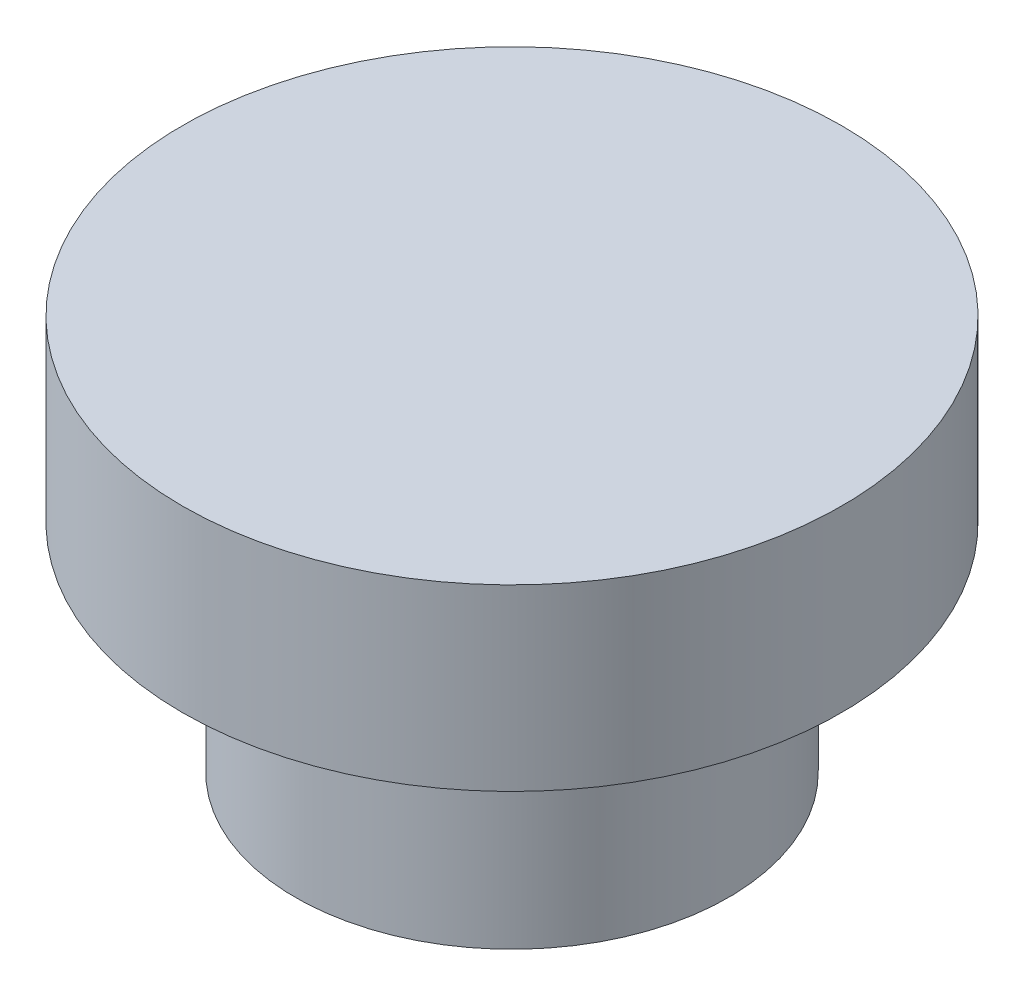
ISO-10303-21;
HEADER;
FILE_DESCRIPTION(('STEP AP214'),'2;1');
FILE_NAME('part.step','',(''),(''),'','','');
FILE_SCHEMA(('AUTOMOTIVE_DESIGN { 1 0 10303 214 1 1 1 1 }'));
ENDSEC;
DATA;
#1=APPLICATION_CONTEXT('core data for automotive mechanical design processes');
#2=APPLICATION_PROTOCOL_DEFINITION('international standard','automotive_design',2000,#1);
#3=PRODUCT_CONTEXT('',#1,'mechanical');
#4=PRODUCT('Part','Part','',(#3));
#5=PRODUCT_RELATED_PRODUCT_CATEGORY('part','',(#4));
#6=PRODUCT_DEFINITION_FORMATION('','',#4);
#7=PRODUCT_DEFINITION_CONTEXT('part definition',#1,'design');
#8=PRODUCT_DEFINITION('design','',#6,#7);
#9=PRODUCT_DEFINITION_SHAPE('','',#8);
#10=(LENGTH_UNIT() NAMED_UNIT(*) SI_UNIT(.MILLI.,.METRE.));
#11=(NAMED_UNIT(*) PLANE_ANGLE_UNIT() SI_UNIT($,.RADIAN.));
#12=(NAMED_UNIT(*) SI_UNIT($,.STERADIAN.) SOLID_ANGLE_UNIT());
#13=UNCERTAINTY_MEASURE_WITH_UNIT(LENGTH_MEASURE(1.E-05),#10,'distance_accuracy_value','');
#14=(GEOMETRIC_REPRESENTATION_CONTEXT(3) GLOBAL_UNCERTAINTY_ASSIGNED_CONTEXT((#13)) GLOBAL_UNIT_ASSIGNED_CONTEXT((#10,
#11,#12)) REPRESENTATION_CONTEXT('',''));
#15=CARTESIAN_POINT('',(0.,0.,0.));
#16=DIRECTION('',(0.,0.,1.));
#17=DIRECTION('',(1.,0.,0.));
#18=AXIS2_PLACEMENT_3D('',#15,#16,#17);
#19=CARTESIAN_POINT('',(2.921,0.,0.));
#20=DIRECTION('',(0.,-1.,0.));
#21=DIRECTION('',(0.,0.,-1.));
#22=AXIS2_PLACEMENT_3D('',#19,#20,#21);
#23=PLANE('',#22);
#24=CARTESIAN_POINT('',(0.,0.,0.));
#25=DIRECTION('',(0.,-1.,0.));
#26=DIRECTION('',(0.,0.,-1.));
#27=AXIS2_PLACEMENT_3D('',#24,#25,#26);
#28=CIRCLE('',#27,2.921);
#29=CARTESIAN_POINT('',(0.,0.,-2.921));
#30=VERTEX_POINT('',#29);
#31=EDGE_CURVE('E46',#30,#30,#28,.T.);
#32=ORIENTED_EDGE('',*,*,#31,.T.);
#33=EDGE_LOOP('',(#32));
#34=FACE_BOUND('',#33,.T.);
#35=ADVANCED_FACE('F32',(#34),#23,.T.);
#36=CARTESIAN_POINT('',(0.,5.334,0.));
#37=DIRECTION('',(0.,1.,0.));
#38=DIRECTION('',(0.,0.,1.));
#39=AXIS2_PLACEMENT_3D('',#36,#37,#38);
#40=PLANE('',#39);
#41=CARTESIAN_POINT('',(0.,5.334,0.));
#42=DIRECTION('',(0.,-1.,0.));
#43=DIRECTION('',(0.,0.,-1.));
#44=AXIS2_PLACEMENT_3D('',#41,#42,#43);
#45=CIRCLE('',#44,4.445);
#46=CARTESIAN_POINT('',(0.,5.334,-4.445));
#47=VERTEX_POINT('',#46);
#48=EDGE_CURVE('E10',#47,#47,#45,.T.);
#49=ORIENTED_EDGE('',*,*,#48,.F.);
#50=EDGE_LOOP('',(#49));
#51=FACE_BOUND('',#50,.T.);
#52=ADVANCED_FACE('F64',(#51),#40,.T.);
#53=CARTESIAN_POINT('',(0.,0.,0.));
#54=DIRECTION('',(0.,-1.,0.));
#55=DIRECTION('',(0.,0.,-1.));
#56=AXIS2_PLACEMENT_3D('',#53,#54,#55);
#57=CYLINDRICAL_SURFACE('',#56,4.445);
#58=ORIENTED_EDGE('',*,*,#48,.T.);
#59=EDGE_LOOP('',(#58));
#60=FACE_BOUND('',#59,.T.);
#61=CARTESIAN_POINT('',(0.,2.921,0.));
#62=DIRECTION('',(0.,-1.,0.));
#63=DIRECTION('',(0.,0.,-1.));
#64=AXIS2_PLACEMENT_3D('',#61,#62,#63);
#65=CIRCLE('',#64,4.445);
#66=CARTESIAN_POINT('',(0.,2.921,-4.445));
#67=VERTEX_POINT('',#66);
#68=EDGE_CURVE('E38',#67,#67,#65,.T.);
#69=ORIENTED_EDGE('',*,*,#68,.F.);
#70=EDGE_LOOP('',(#69));
#71=FACE_BOUND('',#70,.T.);
#72=ADVANCED_FACE('F61',(#60,#71),#57,.T.);
#73=CARTESIAN_POINT('',(4.445,2.921,0.));
#74=DIRECTION('',(0.,-1.,0.));
#75=DIRECTION('',(0.,0.,-1.));
#76=AXIS2_PLACEMENT_3D('',#73,#74,#75);
#77=PLANE('',#76);
#78=ORIENTED_EDGE('',*,*,#68,.T.);
#79=EDGE_LOOP('',(#78));
#80=FACE_BOUND('',#79,.T.);
#81=CARTESIAN_POINT('',(0.,2.921,0.));
#82=DIRECTION('',(0.,-1.,0.));
#83=DIRECTION('',(0.,0.,-1.));
#84=AXIS2_PLACEMENT_3D('',#81,#82,#83);
#85=CIRCLE('',#84,2.921);
#86=CARTESIAN_POINT('',(0.,2.921,-2.921));
#87=VERTEX_POINT('',#86);
#88=EDGE_CURVE('E42',#87,#87,#85,.T.);
#89=ORIENTED_EDGE('',*,*,#88,.F.);
#90=EDGE_LOOP('',(#89));
#91=FACE_BOUND('',#90,.T.);
#92=ADVANCED_FACE('F55',(#80,#91),#77,.T.);
#93=CARTESIAN_POINT('',(0.,0.,0.));
#94=DIRECTION('',(0.,-1.,0.));
#95=DIRECTION('',(0.,0.,-1.));
#96=AXIS2_PLACEMENT_3D('',#93,#94,#95);
#97=CYLINDRICAL_SURFACE('',#96,2.921);
#98=ORIENTED_EDGE('',*,*,#88,.T.);
#99=EDGE_LOOP('',(#98));
#100=FACE_BOUND('',#99,.T.);
#101=ORIENTED_EDGE('',*,*,#31,.F.);
#102=EDGE_LOOP('',(#101));
#103=FACE_BOUND('',#102,.T.);
#104=ADVANCED_FACE('F53',(#100,#103),#97,.T.);
#105=CLOSED_SHELL('',(#35,#52,#72,#92,#104));
#106=MANIFOLD_SOLID_BREP('B2',#105);
#107=ADVANCED_BREP_SHAPE_REPRESENTATION('',(#18,#106),#14);
#108=SHAPE_DEFINITION_REPRESENTATION(#9,#107);
ENDSEC;
END-ISO-10303-21;
